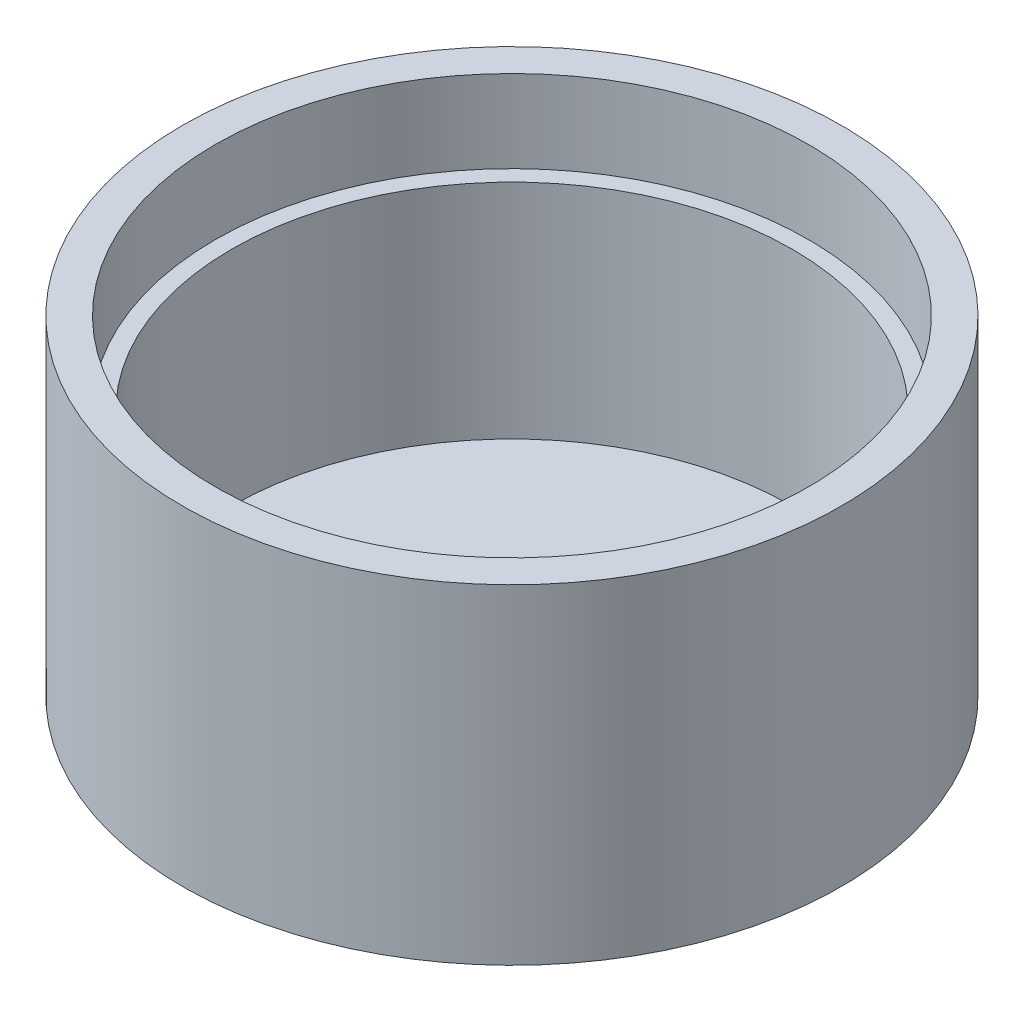
ISO-10303-21;
HEADER;
FILE_DESCRIPTION(('STEP AP214'),'2;1');
FILE_NAME('part.step','',(''),(''),'','','');
FILE_SCHEMA(('AUTOMOTIVE_DESIGN { 1 0 10303 214 1 1 1 1 }'));
ENDSEC;
DATA;
#1=APPLICATION_CONTEXT('core data for automotive mechanical design processes');
#2=APPLICATION_PROTOCOL_DEFINITION('international standard','automotive_design',2000,#1);
#3=PRODUCT_CONTEXT('',#1,'mechanical');
#4=PRODUCT('Part','Part','',(#3));
#5=PRODUCT_RELATED_PRODUCT_CATEGORY('part','',(#4));
#6=PRODUCT_DEFINITION_FORMATION('','',#4);
#7=PRODUCT_DEFINITION_CONTEXT('part definition',#1,'design');
#8=PRODUCT_DEFINITION('design','',#6,#7);
#9=PRODUCT_DEFINITION_SHAPE('','',#8);
#10=(LENGTH_UNIT() NAMED_UNIT(*) SI_UNIT(.MILLI.,.METRE.));
#11=(NAMED_UNIT(*) PLANE_ANGLE_UNIT() SI_UNIT($,.RADIAN.));
#12=(NAMED_UNIT(*) SI_UNIT($,.STERADIAN.) SOLID_ANGLE_UNIT());
#13=UNCERTAINTY_MEASURE_WITH_UNIT(LENGTH_MEASURE(1.E-05),#10,'distance_accuracy_value','');
#14=(GEOMETRIC_REPRESENTATION_CONTEXT(3) GLOBAL_UNCERTAINTY_ASSIGNED_CONTEXT((#13)) GLOBAL_UNIT_ASSIGNED_CONTEXT((#10,
#11,#12)) REPRESENTATION_CONTEXT('',''));
#15=CARTESIAN_POINT('',(0.,0.,0.));
#16=DIRECTION('',(0.,0.,1.));
#17=DIRECTION('',(1.,0.,0.));
#18=AXIS2_PLACEMENT_3D('',#15,#16,#17);
#19=CARTESIAN_POINT('',(0.,0.,0.));
#20=DIRECTION('',(0.,1.,0.));
#21=DIRECTION('',(-1.,0.,0.));
#22=AXIS2_PLACEMENT_3D('',#19,#20,#21);
#23=PLANE('',#22);
#24=CARTESIAN_POINT('',(0.,0.,0.));
#25=DIRECTION('',(0.,1.,0.));
#26=DIRECTION('',(-1.,0.,0.));
#27=AXIS2_PLACEMENT_3D('',#24,#25,#26);
#28=CIRCLE('',#27,20.);
#29=CARTESIAN_POINT('',(-20.,0.,0.));
#30=VERTEX_POINT('',#29);
#31=EDGE_CURVE('E10',#30,#30,#28,.T.);
#32=ORIENTED_EDGE('',*,*,#31,.F.);
#33=EDGE_LOOP('',(#32));
#34=FACE_BOUND('',#33,.T.);
#35=ADVANCED_FACE('F31',(#34),#23,.F.);
#36=CARTESIAN_POINT('',(0.,1.5,0.));
#37=DIRECTION('',(0.,1.,0.));
#38=DIRECTION('',(-1.,0.,0.));
#39=AXIS2_PLACEMENT_3D('',#36,#37,#38);
#40=CYLINDRICAL_SURFACE('',#39,20.);
#41=CARTESIAN_POINT('',(0.,20.,0.));
#42=DIRECTION('',(0.,1.,0.));
#43=DIRECTION('',(-1.,0.,0.));
#44=AXIS2_PLACEMENT_3D('',#41,#42,#43);
#45=CIRCLE('',#44,20.);
#46=CARTESIAN_POINT('',(-20.,20.,0.));
#47=VERTEX_POINT('',#46);
#48=EDGE_CURVE('E37',#47,#47,#45,.T.);
#49=ORIENTED_EDGE('',*,*,#48,.F.);
#50=EDGE_LOOP('',(#49));
#51=FACE_BOUND('',#50,.T.);
#52=ORIENTED_EDGE('',*,*,#31,.T.);
#53=EDGE_LOOP('',(#52));
#54=FACE_BOUND('',#53,.T.);
#55=ADVANCED_FACE('F79',(#51,#54),#40,.T.);
#56=CARTESIAN_POINT('',(20.,20.,0.));
#57=DIRECTION('',(0.,-1.,0.));
#58=DIRECTION('',(1.,0.,0.));
#59=AXIS2_PLACEMENT_3D('',#56,#57,#58);
#60=PLANE('',#59);
#61=CARTESIAN_POINT('',(0.,20.,0.));
#62=DIRECTION('',(0.,1.,0.));
#63=DIRECTION('',(-1.,0.,0.));
#64=AXIS2_PLACEMENT_3D('',#61,#62,#63);
#65=CIRCLE('',#64,18.);
#66=CARTESIAN_POINT('',(-18.,20.,0.));
#67=VERTEX_POINT('',#66);
#68=EDGE_CURVE('E41',#67,#67,#65,.T.);
#69=ORIENTED_EDGE('',*,*,#68,.F.);
#70=EDGE_LOOP('',(#69));
#71=FACE_BOUND('',#70,.T.);
#72=ORIENTED_EDGE('',*,*,#48,.T.);
#73=EDGE_LOOP('',(#72));
#74=FACE_BOUND('',#73,.T.);
#75=ADVANCED_FACE('F74',(#71,#74),#60,.F.);
#76=CARTESIAN_POINT('',(0.,1.5,0.));
#77=DIRECTION('',(0.,1.,0.));
#78=DIRECTION('',(-1.,0.,0.));
#79=AXIS2_PLACEMENT_3D('',#76,#77,#78);
#80=CYLINDRICAL_SURFACE('',#79,18.);
#81=CARTESIAN_POINT('',(0.,15.,0.));
#82=DIRECTION('',(0.,1.,0.));
#83=DIRECTION('',(-1.,0.,0.));
#84=AXIS2_PLACEMENT_3D('',#81,#82,#83);
#85=CIRCLE('',#84,18.);
#86=CARTESIAN_POINT('',(-18.,15.,0.));
#87=VERTEX_POINT('',#86);
#88=EDGE_CURVE('E45',#87,#87,#85,.T.);
#89=ORIENTED_EDGE('',*,*,#88,.F.);
#90=EDGE_LOOP('',(#89));
#91=FACE_BOUND('',#90,.T.);
#92=ORIENTED_EDGE('',*,*,#68,.T.);
#93=EDGE_LOOP('',(#92));
#94=FACE_BOUND('',#93,.T.);
#95=ADVANCED_FACE('F68',(#91,#94),#80,.F.);
#96=CARTESIAN_POINT('',(18.,15.,0.));
#97=DIRECTION('',(0.,-1.,0.));
#98=DIRECTION('',(1.,0.,0.));
#99=AXIS2_PLACEMENT_3D('',#96,#97,#98);
#100=PLANE('',#99);
#101=CARTESIAN_POINT('',(0.,15.,0.));
#102=DIRECTION('',(0.,1.,0.));
#103=DIRECTION('',(-1.,0.,0.));
#104=AXIS2_PLACEMENT_3D('',#101,#102,#103);
#105=CIRCLE('',#104,17.);
#106=CARTESIAN_POINT('',(-17.,15.,0.));
#107=VERTEX_POINT('',#106);
#108=EDGE_CURVE('E50',#107,#107,#105,.T.);
#109=ORIENTED_EDGE('',*,*,#108,.F.);
#110=EDGE_LOOP('',(#109));
#111=FACE_BOUND('',#110,.T.);
#112=ORIENTED_EDGE('',*,*,#88,.T.);
#113=EDGE_LOOP('',(#112));
#114=FACE_BOUND('',#113,.T.);
#115=ADVANCED_FACE('F62',(#111,#114),#100,.F.);
#116=CARTESIAN_POINT('',(0.,1.5,0.));
#117=DIRECTION('',(0.,1.,0.));
#118=DIRECTION('',(-1.,0.,0.));
#119=AXIS2_PLACEMENT_3D('',#116,#117,#118);
#120=CYLINDRICAL_SURFACE('',#119,17.);
#121=CARTESIAN_POINT('',(0.,1.5,0.));
#122=DIRECTION('',(0.,1.,0.));
#123=DIRECTION('',(-1.,0.,0.));
#124=AXIS2_PLACEMENT_3D('',#121,#122,#123);
#125=CIRCLE('',#124,17.);
#126=CARTESIAN_POINT('',(-17.,1.50000000000001,0.));
#127=VERTEX_POINT('',#126);
#128=EDGE_CURVE('E53',#127,#127,#125,.T.);
#129=ORIENTED_EDGE('',*,*,#128,.F.);
#130=EDGE_LOOP('',(#129));
#131=FACE_BOUND('',#130,.T.);
#132=ORIENTED_EDGE('',*,*,#108,.T.);
#133=EDGE_LOOP('',(#132));
#134=FACE_BOUND('',#133,.T.);
#135=ADVANCED_FACE('F59',(#131,#134),#120,.F.);
#136=CARTESIAN_POINT('',(17.,1.5,0.));
#137=DIRECTION('',(0.,-1.,0.));
#138=DIRECTION('',(1.,0.,0.));
#139=AXIS2_PLACEMENT_3D('',#136,#137,#138);
#140=PLANE('',#139);
#141=ORIENTED_EDGE('',*,*,#128,.T.);
#142=EDGE_LOOP('',(#141));
#143=FACE_BOUND('',#142,.T.);
#144=ADVANCED_FACE('F57',(#143),#140,.F.);
#145=CLOSED_SHELL('',(#35,#55,#75,#95,#115,#135,#144));
#146=MANIFOLD_SOLID_BREP('B2',#145);
#147=ADVANCED_BREP_SHAPE_REPRESENTATION('',(#18,#146),#14);
#148=SHAPE_DEFINITION_REPRESENTATION(#9,#147);
ENDSEC;
END-ISO-10303-21;
